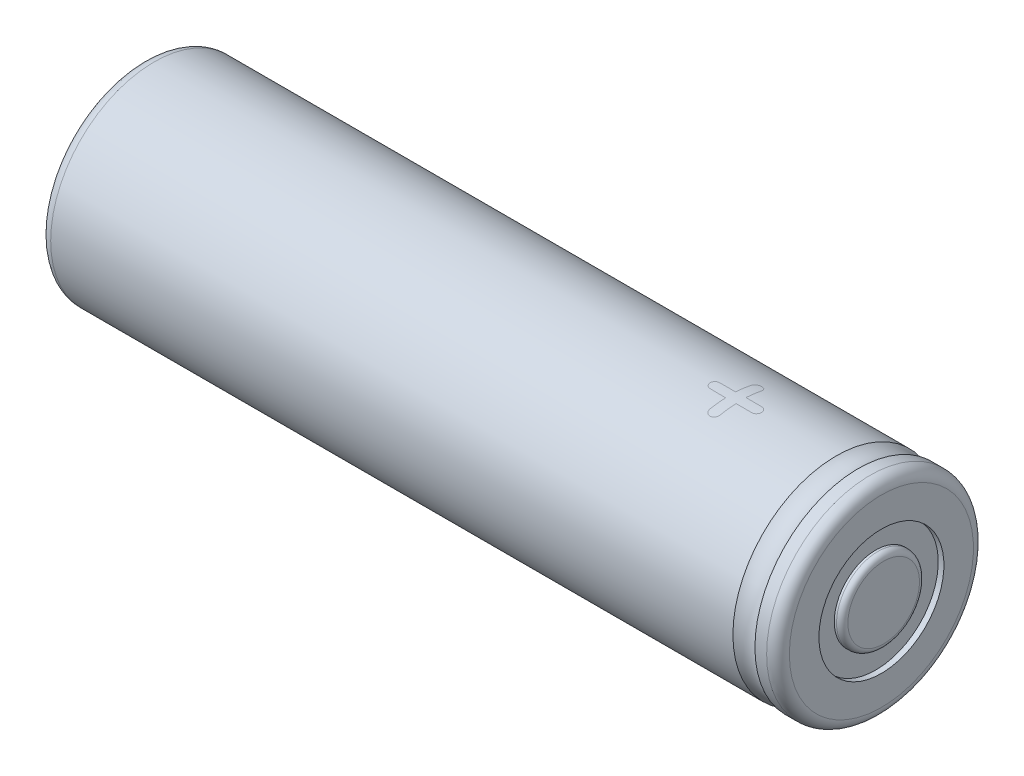
ISO-10303-21;
HEADER;
FILE_DESCRIPTION(('STEP AP214'),'2;1');
FILE_NAME('part.step','',(''),(''),'','','');
FILE_SCHEMA(('AUTOMOTIVE_DESIGN { 1 0 10303 214 1 1 1 1 }'));
ENDSEC;
DATA;
#1=APPLICATION_CONTEXT('core data for automotive mechanical design processes');
#2=APPLICATION_PROTOCOL_DEFINITION('international standard','automotive_design',2000,#1);
#3=PRODUCT_CONTEXT('',#1,'mechanical');
#4=PRODUCT('Part','Part','',(#3));
#5=PRODUCT_RELATED_PRODUCT_CATEGORY('part','',(#4));
#6=PRODUCT_DEFINITION_FORMATION('','',#4);
#7=PRODUCT_DEFINITION_CONTEXT('part definition',#1,'design');
#8=PRODUCT_DEFINITION('design','',#6,#7);
#9=PRODUCT_DEFINITION_SHAPE('','',#8);
#10=(LENGTH_UNIT() NAMED_UNIT(*) SI_UNIT(.MILLI.,.METRE.));
#11=(NAMED_UNIT(*) PLANE_ANGLE_UNIT() SI_UNIT($,.RADIAN.));
#12=(NAMED_UNIT(*) SI_UNIT($,.STERADIAN.) SOLID_ANGLE_UNIT());
#13=UNCERTAINTY_MEASURE_WITH_UNIT(LENGTH_MEASURE(1.E-05),#10,'distance_accuracy_value','');
#14=(GEOMETRIC_REPRESENTATION_CONTEXT(3) GLOBAL_UNCERTAINTY_ASSIGNED_CONTEXT((#13)) GLOBAL_UNIT_ASSIGNED_CONTEXT((#10,
#11,#12)) REPRESENTATION_CONTEXT('',''));
#15=CARTESIAN_POINT('',(0.,0.,0.));
#16=DIRECTION('',(0.,0.,1.));
#17=DIRECTION('',(1.,0.,0.));
#18=AXIS2_PLACEMENT_3D('',#15,#16,#17);
#19=CARTESIAN_POINT('',(0.,0.,0.));
#20=DIRECTION('',(-1.,0.,0.));
#21=DIRECTION('',(0.,0.,1.));
#22=AXIS2_PLACEMENT_3D('',#19,#20,#21);
#23=CYLINDRICAL_SURFACE('',#22,9.1);
#24=CARTESIAN_POINT('',(20.7315370676417,0.,0.));
#25=DIRECTION('',(-0.999897763752425,0.,-0.0142990224456045));
#26=DIRECTION('',(-0.0142990224456045,0.,0.999897763752425));
#27=AXIS2_PLACEMENT_3D('',#24,#25,#26);
#28=ELLIPSE('',#27,9.10093044497814,9.1);
#29=CARTESIAN_POINT('',(20.7058379382622,8.92079031075673,1.7970810308689));
#30=VERTEX_POINT('',#29);
#31=CARTESIAN_POINT('',(20.7251845941311,9.08915144775344,0.444213867187498));
#32=VERTEX_POINT('',#31);
#33=EDGE_CURVE('E11',#30,#32,#28,.T.);
#34=ORIENTED_EDGE('',*,*,#33,.F.);
#35=CARTESIAN_POINT('',(21.1609756097561,8.81651990302727,2.25365853658536));
#36=CARTESIAN_POINT('',(21.1446995451716,8.81685151612312,2.25235846850489));
#37=CARTESIAN_POINT('',(21.1283583713035,8.81719215066898,2.251026880612));
#38=CARTESIAN_POINT('',(21.0957821846135,8.81811883926329,2.24739576488378));
#39=CARTESIAN_POINT('',(21.0795473115098,8.81870516830138,2.24509515246822));
#40=CARTESIAN_POINT('',(21.0475636228122,8.82034546956267,2.23864130508761));
#41=CARTESIAN_POINT('',(21.0318123073446,8.82139633140025,2.23450039130884));
#42=CARTESIAN_POINT('',(21.0008548679472,8.82388493990462,2.22465298757242));
#43=CARTESIAN_POINT('',(20.9856486711145,8.82532263461691,2.21894670785296));
#44=CARTESIAN_POINT('',(20.9591426737148,8.82820371514138,2.20745244571866));
#45=CARTESIAN_POINT('',(20.9477113167555,8.82957814604123,2.20195097842354));
#46=CARTESIAN_POINT('',(20.9254439389612,8.83256818849453,2.18992639432641));
#47=CARTESIAN_POINT('',(20.9146071047449,8.83418345869364,2.18340472288083));
#48=CARTESIAN_POINT('',(20.8937046546578,8.837662372614,2.16928007092448));
#49=CARTESIAN_POINT('',(20.8836391954548,8.8395260665812,2.16167687164401));
#50=CARTESIAN_POINT('',(20.864206446094,8.84343088286279,2.1456463718753));
#51=CARTESIAN_POINT('',(20.8548404899988,8.84547232889591,2.13721756416442));
#52=CARTESIAN_POINT('',(20.8367248255444,8.84964971775683,2.11985370021394));
#53=CARTESIAN_POINT('',(20.8279718238473,8.85178503585409,2.11092190451267));
#54=CARTESIAN_POINT('',(20.8111335134032,8.8561596435771,2.0924928061347));
#55=CARTESIAN_POINT('',(20.8030471327971,8.85839875687958,2.08299645527056));
#56=CARTESIAN_POINT('',(20.7878221710654,8.86300814885538,2.06329553656829));
#57=CARTESIAN_POINT('',(20.7806833404411,8.86537839276697,2.05309115624282));
#58=CARTESIAN_POINT('',(20.7675047435772,8.8702337178362,2.03201142036657));
#59=CARTESIAN_POINT('',(20.7614660460014,8.87271890774513,2.02113542599691));
#60=CARTESIAN_POINT('',(20.75029515672,8.87775298127195,1.99890782250134));
#61=CARTESIAN_POINT('',(20.7451658011318,8.8803020368133,1.98755485737685));
#62=CARTESIAN_POINT('',(20.7356805911642,8.88542272935575,1.96453617556889));
#63=CARTESIAN_POINT('',(20.7313247040413,8.88799436539609,1.95287047214878));
#64=CARTESIAN_POINT('',(20.7235839331376,8.89316411178299,1.92919124924403));
#65=CARTESIAN_POINT('',(20.7202008704774,8.89576226247465,1.91717712318487));
#66=CARTESIAN_POINT('',(20.7160636710626,8.89966429141235,1.89895079776269));
#67=CARTESIAN_POINT('',(20.7148410627941,8.90096537814311,1.89284302496092));
#68=CARTESIAN_POINT('',(20.7127199303954,8.90356620960291,1.88057120369177));
#69=CARTESIAN_POINT('',(20.7118214178225,8.90486595428245,1.87440715322557));
#70=CARTESIAN_POINT('',(20.7103082804406,8.90740139314237,1.86232029453367));
#71=CARTESIAN_POINT('',(20.7096828800221,8.90863738330404,1.85639884074796));
#72=CARTESIAN_POINT('',(20.7086042738874,8.91110094102991,1.84453699391151));
#73=CARTESIAN_POINT('',(20.7081511221844,8.91232850583382,1.83859659550805));
#74=CARTESIAN_POINT('',(20.7073600161197,8.91476885636516,1.82672735185679));
#75=CARTESIAN_POINT('',(20.7070216639164,8.91598167879284,1.82079853899698));
#76=CARTESIAN_POINT('',(20.7064015870404,8.91839510410594,1.80894040004355));
#77=CARTESIAN_POINT('',(20.7061198166485,8.91959571610676,1.80301107826868));
#78=CARTESIAN_POINT('',(20.7058379382622,8.92079031075673,1.7970810308689));
#79=B_SPLINE_CURVE_WITH_KNOTS('',3,(#35,#36,#37,#38,#39,#40,#41,#42,#43,#44,#45,#46,#47,#48,#49,
#50,#51,#52,#53,#54,#55,#56,#57,#58,#59,#60,#61,#62,#63,#64,#65,#66,#67,#68,#69,#70,#71,#72,#73,
#74,#75,#76,#77,#78),.UNSPECIFIED.,.F.,.F.,(4,2,2,2,2,2,2,2,2,2,2,2,2,2,2,2,2,2,2,2,2,4),(0.,
0.0491110553033549,0.0982772248103529,0.14711906306833,0.195954344778998,0.234190793124285,
0.272373553221783,0.310564047878256,0.348825610371183,0.386862676823928,0.424837339584071,
0.462801983340951,0.500803311383232,0.538921151679484,0.577037377933016,0.615224499779135,
0.63430664353342,0.653389467685543,0.671630403991138,0.689877055512403,0.708059810857064,
0.726227814564888),.UNSPECIFIED.);
#80=CARTESIAN_POINT('',(21.1609756097561,8.81651990302727,2.25365853658536));
#81=VERTEX_POINT('',#80);
#82=EDGE_CURVE('E59',#81,#30,#79,.T.);
#83=ORIENTED_EDGE('',*,*,#82,.F.);
#84=CARTESIAN_POINT('',(21.6146341463415,8.92057072275262,1.79817073170732));
#85=CARTESIAN_POINT('',(21.6141890630882,8.9189034028006,1.8064422936715));
#86=CARTESIAN_POINT('',(21.6137434614697,8.91722406305708,1.81471382793186));
#87=CARTESIAN_POINT('',(21.6126996098218,8.9138406714741,1.8312607239287));
#88=CARTESIAN_POINT('',(21.6121010268624,8.91213657348113,1.83953605421109));
#89=CARTESIAN_POINT('',(21.6106020240845,8.90871443333463,1.85603824397045));
#90=CARTESIAN_POINT('',(21.6097023290141,8.9069964342372,1.86426517202132));
#91=CARTESIAN_POINT('',(21.6074360100389,8.90355205742919,1.88064636579637));
#92=CARTESIAN_POINT('',(21.6060698430847,8.90182568954196,1.88880069464702));
#93=CARTESIAN_POINT('',(21.6011396658987,8.89666802142218,1.91299997825978));
#94=CARTESIAN_POINT('',(21.5967378421304,8.89323770352368,1.92887976237281));
#95=CARTESIAN_POINT('',(21.5888930911582,8.88812205313262,1.95226802326923));
#96=CARTESIAN_POINT('',(21.5860691519793,8.88642081922854,1.95999661002743));
#97=CARTESIAN_POINT('',(21.5800676922365,8.88302683177248,1.97532169712688));
#98=CARTESIAN_POINT('',(21.5768900514765,8.88133408130885,1.98291815154621));
#99=CARTESIAN_POINT('',(21.5683069029977,8.87702917139047,2.0021229683645));
#100=CARTESIAN_POINT('',(21.5626429993904,8.87442761562191,2.01362050077341));
#101=CARTESIAN_POINT('',(21.55023963247,8.86931162616813,2.03603599358726));
#102=CARTESIAN_POINT('',(21.5435011875713,8.86679711270644,2.04695448985503));
#103=CARTESIAN_POINT('',(21.5215449829467,8.85945961637271,2.07856924077725));
#104=CARTESIAN_POINT('',(21.5045937816796,8.85484671884553,2.09810684447824));
#105=CARTESIAN_POINT('',(21.4774937895854,8.8482510183197,2.12568590813252));
#106=CARTESIAN_POINT('',(21.4681811609008,8.84610630785324,2.13459138207739));
#107=CARTESIAN_POINT('',(21.4488852504345,8.84196795437397,2.15166909688632));
#108=CARTESIAN_POINT('',(21.4389034275195,8.8399740016917,2.15984284750482));
#109=CARTESIAN_POINT('',(21.418136534536,8.83622744400929,2.1751199492411));
#110=CARTESIAN_POINT('',(21.4073531603897,8.83447435060533,2.18222546931332));
#111=CARTESIAN_POINT('',(21.3850755602787,8.83122997200061,2.19531845250554));
#112=CARTESIAN_POINT('',(21.3735803101218,8.82973907644543,2.20130425246427));
#113=CARTESIAN_POINT('',(21.3507690088202,8.8270602583822,2.21202072785641));
#114=CARTESIAN_POINT('',(21.3394778670917,8.82586018331072,2.21680232382134));
#115=CARTESIAN_POINT('',(21.3165768814203,8.82365644792709,2.22555771154996));
#116=CARTESIAN_POINT('',(21.3049672902893,8.82265263667228,2.22953212419441));
#117=CARTESIAN_POINT('',(21.2814057723453,8.82087752519799,2.23654483744762));
#118=CARTESIAN_POINT('',(21.2694529086563,8.82010694413478,2.239580243288));
#119=CARTESIAN_POINT('',(21.2453066726835,8.81884829707004,2.24453148578082));
#120=CARTESIAN_POINT('',(21.2331133006427,8.81836023078314,2.24644732356417));
#121=CARTESIAN_POINT('',(21.2109046856477,8.8176422429251,2.24926362121947));
#122=CARTESIAN_POINT('',(21.2009038180664,8.81738126828142,2.25028635791437));
#123=CARTESIAN_POINT('',(21.1809256097143,8.81692068497629,2.25209019494509));
#124=CARTESIAN_POINT('',(21.1709483815915,8.81672079174223,2.25287241593119));
#125=CARTESIAN_POINT('',(21.1609756097561,8.81651990302727,2.25365853658536));
#126=B_SPLINE_CURVE_WITH_KNOTS('',3,(#84,#85,#86,#87,#88,#89,#90,#91,#92,#93,#94,#95,#96,#97,
#98,#99,#100,#101,#102,#103,#104,#105,#106,#107,#108,#109,#110,#111,#112,#113,#114,#115,#116,
#117,#118,#119,#120,#121,#122,#123,#124,#125),.UNSPECIFIED.,.F.,.F.,(4,2,2,2,2,2,2,2,2,2,2,2,2,
2,2,2,2,2,2,2,4),(0.,0.0253529277257796,0.0507615074154624,0.0761093657052647,0.101432464415169,
0.151778818140593,0.176981550558468,0.202192873760443,0.241382442727475,0.280535087500243,
0.358898457304724,0.398083485479292,0.437185704771054,0.476207425631231,0.515286654481036,
0.55221680554551,0.589118441657753,0.626132729765143,0.663146980482989,0.693313418812502,
0.723337092913159),.UNSPECIFIED.);
#127=CARTESIAN_POINT('',(21.6146341463415,8.92057072275262,1.79817073170732));
#128=VERTEX_POINT('',#127);
#129=EDGE_CURVE('E188',#128,#81,#126,.T.);
#130=ORIENTED_EDGE('',*,*,#129,.F.);
#131=CARTESIAN_POINT('',(21.6242145852634,0.,0.));
#132=DIRECTION('',(0.999985807146421,0.,0.00532780496272372));
#133=DIRECTION('',(-0.00532780496272372,0.,0.999985807146421));
#134=AXIS2_PLACEMENT_3D('',#131,#132,#133);
#135=ELLIPSE('',#134,9.10012915680068,9.1);
#136=CARTESIAN_POINT('',(21.6219512195122,9.09007876043638,0.4248154058689));
#137=VERTEX_POINT('',#136);
#138=EDGE_CURVE('E196',#137,#128,#135,.T.);
#139=ORIENTED_EDGE('',*,*,#138,.F.);
#140=DIRECTION('',(-1.,0.,0.));
#141=VECTOR('',#140,1.);
#142=CARTESIAN_POINT('',(0.,9.09007876043638,0.4248154058689));
#143=LINE('',#142,#141);
#144=CARTESIAN_POINT('',(22.9748701886433,9.09007876043638,0.4248154058689));
#145=VERTEX_POINT('',#144);
#146=EDGE_CURVE('E463',#145,#137,#143,.T.);
#147=ORIENTED_EDGE('',*,*,#146,.F.);
#148=CARTESIAN_POINT('',(23.4292682926829,9.09999540353938,-0.00914634146341638));
#149=CARTESIAN_POINT('',(23.4281208493471,9.10001118956765,0.00578389545966615));
#150=CARTESIAN_POINT('',(23.4269951304369,9.09998876246969,0.020775448518548));
#151=CARTESIAN_POINT('',(23.4238937268498,9.09987117729846,0.0506261737238683));
#152=CARTESIAN_POINT('',(23.4219200158797,9.09977618771785,0.0654855719892408));
#153=CARTESIAN_POINT('',(23.4162293556709,9.0995170836883,0.0949027810557783));
#154=CARTESIAN_POINT('',(23.4125106721232,9.09935290048515,0.109460276734754));
#155=CARTESIAN_POINT('',(23.4036427257961,9.09896288286951,0.138133445325911));
#156=CARTESIAN_POINT('',(23.3984914443277,9.09873696146892,0.152248463277068));
#157=CARTESIAN_POINT('',(23.3881434578997,9.09827444683621,0.177572934796028));
#158=CARTESIAN_POINT('',(23.3831175893705,9.098046888879,0.188852879291572));
#159=CARTESIAN_POINT('',(23.3721490726587,9.09756155434225,0.210938795317966));
#160=CARTESIAN_POINT('',(23.3662085800642,9.09730384914822,0.221745806474074));
#161=CARTESIAN_POINT('',(23.3531510201058,9.09677105954883,0.24262281452744));
#162=CARTESIAN_POINT('',(23.3460345590837,9.09649598414467,0.252693187402863));
#163=CARTESIAN_POINT('',(23.3307913954609,9.0959374976923,0.2720581937067));
#164=CARTESIAN_POINT('',(23.32266249938,9.0956540695978,0.281351067250115));
#165=CARTESIAN_POINT('',(23.3058337253621,9.0950810051936,0.299301534798952));
#166=CARTESIAN_POINT('',(23.2971370126706,9.09479140850018,0.307962161512337));
#167=CARTESIAN_POINT('',(23.2792657822408,9.09420693475886,0.324761530563112));
#168=CARTESIAN_POINT('',(23.2700917609811,9.09391206339902,0.332900796282754));
#169=CARTESIAN_POINT('',(23.2510108589374,9.09333402778027,0.348333098158552));
#170=CARTESIAN_POINT('',(23.2411027729633,9.09305088401934,0.355624689827659));
#171=CARTESIAN_POINT('',(23.2204683831979,9.09252084498018,0.368930958894549));
#172=CARTESIAN_POINT('',(23.2097425975252,9.09227392703359,0.374946435883762));
#173=CARTESIAN_POINT('',(23.1883377058832,9.09182879071959,0.385585248533543));
#174=CARTESIAN_POINT('',(23.1776858140358,9.09162869404729,0.390265163093818));
#175=CARTESIAN_POINT('',(23.156089014944,9.09125178281849,0.39894809241368));
#176=CARTESIAN_POINT('',(23.1451435737797,9.0910750147144,0.402949761004605));
#177=CARTESIAN_POINT('',(23.1230032205378,9.09074905623666,0.410237457766873));
#178=CARTESIAN_POINT('',(23.1118081183881,9.09059988773829,0.4135229186408));
#179=CARTESIAN_POINT('',(23.0891689065356,9.09034929986164,0.418995332189791));
#180=CARTESIAN_POINT('',(23.0777256671608,9.09024773524609,0.421185627548758));
#181=CARTESIAN_POINT('',(23.0510765968299,9.09008774644941,0.424629136688561));
#182=CARTESIAN_POINT('',(23.0358120045286,9.09005270774622,0.425375926326103));
#183=CARTESIAN_POINT('',(23.0052844051174,9.09003816577219,0.425679795523179));
#184=CARTESIAN_POINT('',(22.9900214512383,9.09005855599968,0.425239156633376));
#185=CARTESIAN_POINT('',(22.9748701886433,9.09007876043638,0.4248154058689));
#186=B_SPLINE_CURVE_WITH_KNOTS('',3,(#148,#149,#150,#151,#152,#153,#154,#155,#156,#157,#158,
#159,#160,#161,#162,#163,#164,#165,#166,#167,#168,#169,#170,#171,#172,#173,#174,#175,#176,#177,
#178,#179,#180,#181,#182,#183,#184,#185),.UNSPECIFIED.,.F.,.F.,(4,2,2,2,2,2,2,2,2,2,2,2,2,2,2,2,
2,2,4),(0.,0.0450273109756248,0.0899503835635508,0.134918199574334,0.179949704105758,
0.216976682470676,0.253917694912855,0.290839719267321,0.327843175463298,0.364655550166914,
0.401430371086206,0.438266967352991,0.475080413821632,0.509957684044154,0.544903387292589,
0.579876670736081,0.614742546343617,0.660499322225608,0.706168242773928),.UNSPECIFIED.);
#187=CARTESIAN_POINT('',(23.4292682926829,9.09999540353938,-0.00914634146341638));
#188=VERTEX_POINT('',#187);
#189=EDGE_CURVE('E180',#188,#145,#186,.T.);
#190=ORIENTED_EDGE('',*,*,#189,.F.);
#191=CARTESIAN_POINT('',(22.9737804878049,9.08813045186157,-0.464634146341465));
#192=CARTESIAN_POINT('',(22.982244753439,9.08815370048562,-0.464178924296654));
#193=CARTESIAN_POINT('',(22.9907116413474,9.08817701165985,-0.463722727406795));
#194=CARTESIAN_POINT('',(23.0076562172441,9.088231900067,-0.462646031817967));
#195=CARTESIAN_POINT('',(23.0161338772456,9.0882634983448,-0.462025114769526));
#196=CARTESIAN_POINT('',(23.0330428154186,9.08834297562677,-0.460459080436611));
#197=CARTESIAN_POINT('',(23.0414741551406,9.08839081761746,-0.45951470016424));
#198=CARTESIAN_POINT('',(23.0582563577063,9.08851161543601,-0.457119328497514));
#199=CARTESIAN_POINT('',(23.0666073053503,9.08858454090363,-0.455668949517724));
#200=CARTESIAN_POINT('',(23.0913374469466,9.08884463360491,-0.450460939474377));
#201=CARTESIAN_POINT('',(23.1075385924805,9.08907363207815,-0.445836789886009));
#202=CARTESIAN_POINT('',(23.1313829731244,9.08947092829883,-0.437636543986923));
#203=CARTESIAN_POINT('',(23.1392600501238,9.08961244075608,-0.434690036718647));
#204=CARTESIAN_POINT('',(23.1548690056065,9.08990931361867,-0.428437291030943));
#205=CARTESIAN_POINT('',(23.1626009230062,9.09006467024638,-0.425131150689581));
#206=CARTESIAN_POINT('',(23.181761484244,9.09047164067522,-0.41635721738095));
#207=CARTESIAN_POINT('',(23.1930793172072,9.09073215852568,-0.410642608491133));
#208=CARTESIAN_POINT('',(23.2150928343565,9.0912877162593,-0.398154814019927));
#209=CARTESIAN_POINT('',(23.2257897050198,9.09158268682952,-0.391383744938246));
#210=CARTESIAN_POINT('',(23.2567615751343,9.09250949261085,-0.369430651273671));
#211=CARTESIAN_POINT('',(23.2758794303217,9.09318239866712,-0.352625439654171));
#212=CARTESIAN_POINT('',(23.3028543987072,9.09416800276973,-0.325870895225242));
#213=CARTESIAN_POINT('',(23.3115577357682,9.09449239195037,-0.316700853722561));
#214=CARTESIAN_POINT('',(23.328229741459,9.09513330118516,-0.29772338712927));
#215=CARTESIAN_POINT('',(23.3361997898363,9.09544983516419,-0.287917220836018));
#216=CARTESIAN_POINT('',(23.3510993632564,9.09607093303421,-0.267575481125202));
#217=CARTESIAN_POINT('',(23.3580313083104,9.09637552350319,-0.257041690506255));
#218=CARTESIAN_POINT('',(23.3708184946283,9.09696318969828,-0.235326531702933));
#219=CARTESIAN_POINT('',(23.3766723896489,9.09724623826816,-0.224144376450886));
#220=CARTESIAN_POINT('',(23.387248136189,9.09777056923913,-0.201723565761601));
#221=CARTESIAN_POINT('',(23.3920016053193,9.09801294126943,-0.190499641662083));
#222=CARTESIAN_POINT('',(23.4006653827326,9.0984610623369,-0.167737481001098));
#223=CARTESIAN_POINT('',(23.40457616114,9.09866683178284,-0.156199423757882));
#224=CARTESIAN_POINT('',(23.4114934638919,9.0990383854385,-0.132807200124373));
#225=CARTESIAN_POINT('',(23.4144968026332,9.09920402838837,-0.120952075573328));
#226=CARTESIAN_POINT('',(23.4194633987658,9.09949055075732,-0.097028691916884));
#227=CARTESIAN_POINT('',(23.4214267023467,9.09961143216427,-0.0849604423012982));
#228=CARTESIAN_POINT('',(23.424435172751,9.09979331962335,-0.0622431482214596));
#229=CARTESIAN_POINT('',(23.4255640984291,9.09985989831781,-0.0516040410779573));
#230=CARTESIAN_POINT('',(23.4275483049387,9.0999555527544,-0.0303565998557121));
#231=CARTESIAN_POINT('',(23.4284050222077,9.09998482789986,-0.0197484071710816));
#232=CARTESIAN_POINT('',(23.4292682926829,9.09999540353938,-0.00914634146341638));
#233=B_SPLINE_CURVE_WITH_KNOTS('',3,(#191,#192,#193,#194,#195,#196,#197,#198,#199,#200,#201,
#202,#203,#204,#205,#206,#207,#208,#209,#210,#211,#212,#213,#214,#215,#216,#217,#218,#219,#220,
#221,#222,#223,#224,#225,#226,#227,#228,#229,#230,#231,#232),.UNSPECIFIED.,.F.,.F.,(4,2,2,2,2,2,
2,2,2,2,2,2,2,2,2,2,2,2,2,2,4),(0.,0.0254340130217014,0.05093325121388,0.0763747715963511,
0.101785606105062,0.152176459067852,0.177406039934964,0.202628757434615,0.240624581342772,
0.278545239787364,0.354509443579337,0.392446331500804,0.430310311988243,0.468084602497733,
0.50590574943264,0.542446369709141,0.578966551445999,0.61561348770599,0.652258796282871,
0.684351779784454,0.716272482943191),.UNSPECIFIED.);
#234=CARTESIAN_POINT('',(22.9737804878049,9.08813045186157,-0.464634146341465));
#235=VERTEX_POINT('',#234);
#236=EDGE_CURVE('E172',#235,#188,#233,.T.);
#237=ORIENTED_EDGE('',*,*,#236,.F.);
#238=CARTESIAN_POINT('',(110.407694895674,0.,0.));
#239=DIRECTION('',(0.00531404305786231,0.,-0.999985880373508));
#240=DIRECTION('',(-0.999985880373508,0.,-0.00531404305786231));
#241=AXIS2_PLACEMENT_3D('',#238,#239,#240);
#242=ELLIPSE('',#241,1712.44378355878,9.1);
#243=CARTESIAN_POINT('',(21.5968684498857,9.08775341029899,-0.471951219512197));
#244=VERTEX_POINT('',#243);
#245=EDGE_CURVE('E474',#244,#235,#242,.T.);
#246=ORIENTED_EDGE('',*,*,#245,.F.);
#247=CARTESIAN_POINT('',(21.5968684498857,0.,0.));
#248=DIRECTION('',(1.,0.,0.));
#249=DIRECTION('',(0.,0.,-1.));
#250=AXIS2_PLACEMENT_3D('',#247,#248,#249);
#251=CIRCLE('',#250,9.1);
#252=CARTESIAN_POINT('',(21.5968684498857,8.91514715496054,-1.82487018864329));
#253=VERTEX_POINT('',#252);
#254=EDGE_CURVE('E479',#253,#244,#251,.T.);
#255=ORIENTED_EDGE('',*,*,#254,.F.);
#256=CARTESIAN_POINT('',(21.1719512195122,8.80993394129436,-2.27926829268293));
#257=CARTESIAN_POINT('',(21.1865316014072,8.81022651354335,-2.27813548432237));
#258=CARTESIAN_POINT('',(21.2011675517398,8.81051369556689,-2.27702612411326));
#259=CARTESIAN_POINT('',(21.2303370769914,8.81128809259746,-2.27402888930656));
#260=CARTESIAN_POINT('',(21.2448707089271,8.81177518544483,-2.27214149014272));
#261=CARTESIAN_POINT('',(21.2736156562705,8.81315886982819,-2.26676802110397));
#262=CARTESIAN_POINT('',(21.2878274826658,8.81405475618989,-2.26328470416661));
#263=CARTESIAN_POINT('',(21.3157892905751,8.81620440399447,-2.25489656096359));
#264=CARTESIAN_POINT('',(21.3295390291629,8.81745835048416,-2.24999099965659));
#265=CARTESIAN_POINT('',(21.3538228852717,8.81995574819648,-2.2401788215477));
#266=CARTESIAN_POINT('',(21.3644444023008,8.82114991805928,-2.23547352523137));
#267=CARTESIAN_POINT('',(21.3852523539525,8.82373608826004,-2.2252436619206));
#268=CARTESIAN_POINT('',(21.3954393364801,8.82512782927776,-2.21972016843679));
#269=CARTESIAN_POINT('',(21.4151773869095,8.82815003711759,-2.20766964629837));
#270=CARTESIAN_POINT('',(21.4247281788761,8.82978060655857,-2.20114218620258));
#271=CARTESIAN_POINT('',(21.4430700505761,8.83325959441451,-2.18713889617956));
#272=CARTESIAN_POINT('',(21.4518604460704,8.83510820557021,-2.17966222673415));
#273=CARTESIAN_POINT('',(21.4687315154896,8.83892759674932,-2.16412166067135));
#274=CARTESIAN_POINT('',(21.4768172711136,8.84089729002601,-2.15606289884562));
#275=CARTESIAN_POINT('',(21.4924964973481,8.84492062197044,-2.13949815692725));
#276=CARTESIAN_POINT('',(21.5000898891198,8.8469742739965,-2.13099210560613));
#277=CARTESIAN_POINT('',(21.514652229518,8.85117367069491,-2.11348186979702));
#278=CARTESIAN_POINT('',(21.5216213979955,8.85331938254692,-2.10447786251026));
#279=CARTESIAN_POINT('',(21.5347391770737,8.85771016202638,-2.08591978826195));
#280=CARTESIAN_POINT('',(21.5408884748464,8.85995514432184,-2.07636619167509));
#281=CARTESIAN_POINT('',(21.5519669228379,8.8644199001468,-2.05721936372698));
#282=CARTESIAN_POINT('',(21.5569412597486,8.86663546669543,-2.04765127307922));
#283=CARTESIAN_POINT('',(21.5660346761764,8.87112303656488,-2.02812144877161));
#284=CARTESIAN_POINT('',(21.5701531435323,8.87339507898852,-2.01815943938167));
#285=CARTESIAN_POINT('',(21.5774974979848,8.87797809275308,-1.99790212857174));
#286=CARTESIAN_POINT('',(21.5807219886468,8.8802891190823,-1.98760633346736));
#287=CARTESIAN_POINT('',(21.5862748391796,8.88492292534587,-1.9667888183272));
#288=CARTESIAN_POINT('',(21.5886039092308,8.88724569447904,-1.95626728435303));
#289=CARTESIAN_POINT('',(21.5922666776134,8.89174340932145,-1.93571767035525));
#290=CARTESIAN_POINT('',(21.593652710964,8.89391867470098,-1.92569895767968));
#291=CARTESIAN_POINT('',(21.5956636755487,8.89825242476646,-1.90557335936342));
#292=CARTESIAN_POINT('',(21.5962877785428,8.90041088866174,-1.89546638977874));
#293=CARTESIAN_POINT('',(21.5970283076082,8.90468840463755,-1.87526817476465));
#294=CARTESIAN_POINT('',(21.5971464866072,8.90680756742915,-1.86517699634014));
#295=CARTESIAN_POINT('',(21.5971320529872,8.91100619648758,-1.84501338621515));
#296=CARTESIAN_POINT('',(21.5970001031093,8.91308575295151,-1.83494097555874));
#297=CARTESIAN_POINT('',(21.5968684498857,8.91514715496054,-1.82487018864329));
#298=B_SPLINE_CURVE_WITH_KNOTS('',3,(#256,#257,#258,#259,#260,#261,#262,#263,#264,#265,#266,
#267,#268,#269,#270,#271,#272,#273,#274,#275,#276,#277,#278,#279,#280,#281,#282,#283,#284,#285,
#286,#287,#288,#289,#290,#291,#292,#293,#294,#295,#296,#297),.UNSPECIFIED.,.F.,.F.,(4,2,2,2,2,2,
2,2,2,2,2,2,2,2,2,2,2,2,2,2,4),(0.,0.0439756519734563,0.0879244716271192,0.131797763920123,
0.175693771258747,0.21070198383622,0.245664664400734,0.280642411905861,0.315651313482311,
0.350382202141459,0.385118638358276,0.419842791922466,0.454537656088675,0.487523237341808,
0.520532330956155,0.553592699521735,0.586626792722073,0.617632606731382,0.648672095012396,
0.679603950042862,0.710453962613161),.UNSPECIFIED.);
#299=CARTESIAN_POINT('',(21.1719512195122,8.80993394129436,-2.27926829268293));
#300=VERTEX_POINT('',#299);
#301=EDGE_CURVE('E163',#300,#253,#298,.T.);
#302=ORIENTED_EDGE('',*,*,#301,.F.);
#303=CARTESIAN_POINT('',(20.7237804878049,8.91537013994945,-1.82378048780488));
#304=CARTESIAN_POINT('',(20.7244406037768,8.91357199745777,-1.83257067810455));
#305=CARTESIAN_POINT('',(20.7251015314456,8.9117604110163,-1.84136007587941));
#306=CARTESIAN_POINT('',(20.7265693337254,8.90811071460535,-1.85893627253013));
#307=CARTESIAN_POINT('',(20.7273764516993,8.90627256518404,-1.86772304222425));
#308=CARTESIAN_POINT('',(20.7292822055083,8.90257131293706,-1.88528638471382));
#309=CARTESIAN_POINT('',(20.7303816023271,8.90070815720491,-1.89406286993886));
#310=CARTESIAN_POINT('',(20.7330288045744,8.89697102945045,-1.91154031075334));
#311=CARTESIAN_POINT('',(20.7345762845167,8.89509706624363,-1.9202413164624));
#312=CARTESIAN_POINT('',(20.7400253740028,8.88947149423401,-1.94617806617928));
#313=CARTESIAN_POINT('',(20.74473382819,8.88571571064869,-1.96324987729814));
#314=CARTESIAN_POINT('',(20.756057108345,8.87825481622357,-1.99671869925177));
#315=CARTESIAN_POINT('',(20.76266921538,8.87454964095183,-2.01311663465926));
#316=CARTESIAN_POINT('',(20.7805731116973,8.8658670256783,-2.05107497767429));
#317=CARTESIAN_POINT('',(20.7926898957299,8.86093384095769,-2.072263864165));
#318=CARTESIAN_POINT('',(20.8203322126274,8.85145312428598,-2.11239239353716));
#319=CARTESIAN_POINT('',(20.8358541362168,8.84690519101014,-2.13133438550384));
#320=CARTESIAN_POINT('',(20.8616011353959,8.84056213047152,-2.1574389727912));
#321=CARTESIAN_POINT('',(20.8706079124408,8.83852517140118,-2.16576539140597));
#322=CARTESIAN_POINT('',(20.8893291980323,8.83462114453049,-2.18163605047057));
#323=CARTESIAN_POINT('',(20.8990441530786,8.83275418561128,-2.18917979005791));
#324=CARTESIAN_POINT('',(20.9190216571532,8.82919124636357,-2.20350544318902));
#325=CARTESIAN_POINT('',(20.9292832508112,8.8274949817924,-2.21028862545036));
#326=CARTESIAN_POINT('',(20.9503227746716,8.82428978985768,-2.22305033980624));
#327=CARTESIAN_POINT('',(20.961100566093,8.82278081252902,-2.22902908654669));
#328=CARTESIAN_POINT('',(20.9833933636591,8.8199722835059,-2.24011660465757));
#329=CARTESIAN_POINT('',(20.9949186549095,8.81867739590296,-2.24520611134958));
#330=CARTESIAN_POINT('',(21.0184381981612,8.81637359392435,-2.25423569746744));
#331=CARTESIAN_POINT('',(21.0304324569702,8.81536468370186,-2.25817576020021));
#332=CARTESIAN_POINT('',(21.0547759866323,8.81363270864862,-2.26492615552751));
#333=CARTESIAN_POINT('',(21.0671257921744,8.81291010135771,-2.26773467993399));
#334=CARTESIAN_POINT('',(21.0920450159465,8.81176288163467,-2.27218847799736));
#335=CARTESIAN_POINT('',(21.1046145158231,8.8113383825126,-2.2738333093396));
#336=CARTESIAN_POINT('',(21.1263381901833,8.81076272067806,-2.27606262020662));
#337=CARTESIAN_POINT('',(21.135477110013,8.8105684494472,-2.27681447701544));
#338=CARTESIAN_POINT('',(21.1537284742555,8.81022768601304,-2.27813267453928));
#339=CARTESIAN_POINT('',(21.1628408525054,8.81008098254098,-2.27869983561721));
#340=CARTESIAN_POINT('',(21.1719512195122,8.80993394129436,-2.27926829268293));
#341=B_SPLINE_CURVE_WITH_KNOTS('',3,(#303,#304,#305,#306,#307,#308,#309,#310,#311,#312,#313,
#314,#315,#316,#317,#318,#319,#320,#321,#322,#323,#324,#325,#326,#327,#328,#329,#330,#331,#332,
#333,#334,#335,#336,#337,#338,#339,#340),.UNSPECIFIED.,.F.,.F.,(4,2,2,2,2,2,2,2,2,2,2,2,2,2,2,2,
2,2,4),(0.,0.0269926686728523,0.054030692076475,0.0811398136681195,0.108229292465418,
0.16240111626455,0.216495948615596,0.290887621572727,0.365200820864892,0.40245761773296,
0.439738111295909,0.476955460207725,0.514162858711581,0.552096703274211,0.590031098712827,
0.628025874807441,0.66603508480279,0.693549544300659,0.720940070885291),.UNSPECIFIED.);
#342=CARTESIAN_POINT('',(20.7237804878049,8.91537013994945,-1.82378048780488));
#343=VERTEX_POINT('',#342);
#344=EDGE_CURVE('E154',#343,#300,#341,.T.);
#345=ORIENTED_EDGE('',*,*,#344,.F.);
#346=CARTESIAN_POINT('',(20.6999461740492,0.,0.));
#347=DIRECTION('',(-0.999914616382009,0.,-0.0130675148983647));
#348=DIRECTION('',(-0.0130675148983647,0.,0.999914616382009));
#349=AXIS2_PLACEMENT_3D('',#346,#347,#348);
#350=ELLIPSE('',#349,9.10077705727168,9.1);
#351=CARTESIAN_POINT('',(20.7057861328125,9.0890213218199,-0.446868449885673));
#352=VERTEX_POINT('',#351);
#353=EDGE_CURVE('E492',#352,#343,#350,.T.);
#354=ORIENTED_EDGE('',*,*,#353,.F.);
#355=DIRECTION('',(-1.,0.,0.));
#356=VECTOR('',#355,1.);
#357=CARTESIAN_POINT('',(0.,9.0890213218199,-0.446868449885673));
#358=LINE('',#357,#356);
#359=CARTESIAN_POINT('',(19.3528671636814,9.0890213218199,-0.446868449885673));
#360=VERTEX_POINT('',#359);
#361=EDGE_CURVE('E497',#360,#352,#358,.F.);
#362=ORIENTED_EDGE('',*,*,#361,.F.);
#363=CARTESIAN_POINT('',(18.8963414634146,9.099973524355,-0.0219512195121971));
#364=CARTESIAN_POINT('',(18.8975349072868,9.09993689243342,-0.0375259611356789));
#365=CARTESIAN_POINT('',(18.8987285103499,9.09985827442531,-0.0531696399060796));
#366=CARTESIAN_POINT('',(18.9020669624319,9.09962230776641,-0.0843315763062963));
#367=CARTESIAN_POINT('',(18.9042110323187,9.09946502358762,-0.0998499260854827));
#368=CARTESIAN_POINT('',(18.9103835270771,9.09907793390595,-0.130441659677079));
#369=CARTESIAN_POINT('',(18.9144017468056,9.09884852332474,-0.145516989002737));
#370=CARTESIAN_POINT('',(18.9239543675164,9.09832597507283,-0.175170225240194));
#371=CARTESIAN_POINT('',(18.9294898372999,9.0980327925092,-0.189747773327144));
#372=CARTESIAN_POINT('',(18.9403117670631,9.09747140096469,-0.214776716463538));
#373=CARTESIAN_POINT('',(18.9453161381691,9.09721519401944,-0.225350590926082));
#374=CARTESIAN_POINT('',(18.9562307137892,9.09668000975007,-0.246006300065252));
#375=CARTESIAN_POINT('',(18.9621391995941,9.09640107608988,-0.256089021452913));
#376=CARTESIAN_POINT('',(18.9750411885377,9.09583221343058,-0.275557422593053));
#377=CARTESIAN_POINT('',(18.9820361956156,9.09554226961821,-0.284942109103759));
#378=CARTESIAN_POINT('',(18.9969094127807,9.094958768982,-0.302996644718762));
#379=CARTESIAN_POINT('',(19.0047890871257,9.09466520690595,-0.311665266218186));
#380=CARTESIAN_POINT('',(19.0210715917737,9.09407786887373,-0.328354523065873));
#381=CARTESIAN_POINT('',(19.0294698169112,9.09378411278226,-0.336379721067111));
#382=CARTESIAN_POINT('',(19.0467338995774,9.09319661460334,-0.351902237062148));
#383=CARTESIAN_POINT('',(19.0555994726184,9.09290287261386,-0.359399869854899));
#384=CARTESIAN_POINT('',(19.0738834703092,9.0923280021264,-0.37366085898225));
#385=CARTESIAN_POINT('',(19.0833007823835,9.09204685013338,-0.380425619610654));
#386=CARTESIAN_POINT('',(19.1027326521137,9.09151051618334,-0.393035125475645));
#387=CARTESIAN_POINT('',(19.1127470696922,9.09125532817304,-0.39888008533017));
#388=CARTESIAN_POINT('',(19.1340580752605,9.0907610767367,-0.409995437489377));
#389=CARTESIAN_POINT('',(19.1453944757144,9.09052466282267,-0.415189733002503));
#390=CARTESIAN_POINT('',(19.168544266646,9.09009949242818,-0.424396669502729));
#391=CARTESIAN_POINT('',(19.1803578928314,9.08991075984037,-0.428408718244604));
#392=CARTESIAN_POINT('',(19.2043729129612,9.08958585635304,-0.435247916171234));
#393=CARTESIAN_POINT('',(19.2165756581161,9.0894498967241,-0.438070306487104));
#394=CARTESIAN_POINT('',(19.2411907340302,9.08923435730034,-0.44251971989554));
#395=CARTESIAN_POINT('',(19.2536029394568,9.08915474493441,-0.444147433581985));
#396=CARTESIAN_POINT('',(19.2805370559118,9.08904069339458,-0.446476345353063));
#397=CARTESIAN_POINT('',(19.295073317183,9.08901572355336,-0.446983461478308));
#398=CARTESIAN_POINT('',(19.3240423778417,9.08900135737741,-0.447273225236768));
#399=CARTESIAN_POINT('',(19.3384750696324,9.08901167670431,-0.447061663623643));
#400=CARTESIAN_POINT('',(19.3528671636814,9.0890213218199,-0.446868449885672));
#401=B_SPLINE_CURVE_WITH_KNOTS('',3,(#363,#364,#365,#366,#367,#368,#369,#370,#371,#372,#373,
#374,#375,#376,#377,#378,#379,#380,#381,#382,#383,#384,#385,#386,#387,#388,#389,#390,#391,#392,
#393,#394,#395,#396,#397,#398,#399,#400),.UNSPECIFIED.,.F.,.F.,(4,2,2,2,2,2,2,2,2,2,2,2,2,2,2,2,
2,2,4),(0.,0.0469818369599602,0.0939252322168754,0.140615942690019,0.187339628554808,
0.222412590416555,0.257419688888855,0.292475682482329,0.327590579101443,0.362429127695882,
0.39724670862345,0.431996347638431,0.466737866428255,0.504088022065062,0.541456856536825,
0.578973786808812,0.61646901295481,0.660071153335096,0.703322805077136),.UNSPECIFIED.);
#402=CARTESIAN_POINT('',(18.8963414634146,9.099973524355,-0.0219512195121971));
#403=VERTEX_POINT('',#402);
#404=EDGE_CURVE('E122',#403,#360,#401,.T.);
#405=ORIENTED_EDGE('',*,*,#404,.F.);
#406=CARTESIAN_POINT('',(19.3518292682927,9.09001303230222,0.42621951219512));
#407=CARTESIAN_POINT('',(19.3426869000199,9.09004675440204,0.425499513371402));
#408=CARTESIAN_POINT('',(19.3335417701014,9.09008054775203,0.424777720726966));
#409=CARTESIAN_POINT('',(19.3152477387379,9.09015636555445,0.423152579091512));
#410=CARTESIAN_POINT('',(19.3060988742891,9.09019840817861,0.42224882916294));
#411=CARTESIAN_POINT('',(19.2878261407437,9.09029881085389,0.42008178808736));
#412=CARTESIAN_POINT('',(19.2787023310404,9.09035719569081,0.41881795075261));
#413=CARTESIAN_POINT('',(19.2605581599067,9.09049905277465,0.41572748567733));
#414=CARTESIAN_POINT('',(19.2515377026804,9.09058249943971,0.41390143177159));
#415=CARTESIAN_POINT('',(19.2247653711005,9.09087043963507,0.40754447305424));
#416=CARTESIAN_POINT('',(19.2072215081836,9.09111292939996,0.402126596429757));
#417=CARTESIAN_POINT('',(19.172870849622,9.09166757974929,0.389386483075189));
#418=CARTESIAN_POINT('',(19.1560633845859,9.09197967542048,0.382066019619947));
#419=CARTESIAN_POINT('',(19.1285266963797,9.09255403823878,0.368094259432691));
#420=CARTESIAN_POINT('',(19.1175403313924,9.0928013673922,0.361949579292129));
#421=CARTESIAN_POINT('',(19.0961708552907,9.09331927015679,0.348695308611946));
#422=CARTESIAN_POINT('',(19.085787473172,9.09358983318807,0.341586156412932));
#423=CARTESIAN_POINT('',(19.0656891466193,9.09414425408986,0.326492260080957));
#424=CARTESIAN_POINT('',(19.0559738445874,9.0944281047091,0.318507990396407));
#425=CARTESIAN_POINT('',(19.0372084358808,9.0949981857445,0.301791311709651));
#426=CARTESIAN_POINT('',(19.0281587685441,9.09528441759607,0.293058416681747));
#427=CARTESIAN_POINT('',(19.0020604712384,9.09613615901844,0.265781378125729));
#428=CARTESIAN_POINT('',(18.9860778220553,9.09669427098061,0.246170462341784));
#429=CARTESIAN_POINT('',(18.9581359028285,9.09772964739308,0.2043162826528));
#430=CARTESIAN_POINT('',(18.9461693682387,9.09820705703654,0.182077871128345));
#431=CARTESIAN_POINT('',(18.9311527942915,9.09880386225712,0.147967075206051));
#432=CARTESIAN_POINT('',(18.9266913050569,9.09898075044556,0.136679008164194));
#433=CARTESIAN_POINT('',(18.9186803143581,9.09929569665242,0.113789266953745));
#434=CARTESIAN_POINT('',(18.9151297130033,9.09943380152069,0.102187989880444));
#435=CARTESIAN_POINT('',(18.9090994412171,9.09966741376389,0.0786847724698439));
#436=CARTESIAN_POINT('',(18.9066219004218,9.09976283644232,0.0667822834109033));
#437=CARTESIAN_POINT('',(18.9026544025433,9.09990717923066,0.0428138873551689));
#438=CARTESIAN_POINT('',(18.9011651409883,9.09995606660056,0.0307478713530671));
#439=CARTESIAN_POINT('',(18.8992180586814,9.09999475816029,0.0118903911035203));
#440=CARTESIAN_POINT('',(18.8985946716371,9.1000010912779,0.00511308229484083));
#441=CARTESIAN_POINT('',(18.8974274837103,9.09999860713577,-0.00842644843961993));
#442=CARTESIAN_POINT('',(18.8968834320145,9.09998983879642,-0.0151886482926292));
#443=CARTESIAN_POINT('',(18.8963414634146,9.099973524355,-0.0219512195121971));
#444=B_SPLINE_CURVE_WITH_KNOTS('',3,(#406,#407,#408,#409,#410,#411,#412,#413,#414,#415,#416,
#417,#418,#419,#420,#421,#422,#423,#424,#425,#426,#427,#428,#429,#430,#431,#432,#433,#434,#435,
#436,#437,#438,#439,#440,#441,#442,#443),.UNSPECIFIED.,.F.,.F.,(4,2,2,2,2,2,2,2,2,2,2,2,2,2,2,2,
2,2,4),(0.,0.0275169644862017,0.0550952387720946,0.0827155690889201,0.110307801235651,
0.165250045989279,0.220141265226351,0.257867148359201,0.295575942629022,0.333264393116586,
0.370977499901714,0.446460674732154,0.521806566564108,0.558201791118753,0.594552859627492,
0.6309757448802,0.667424236616843,0.687842369426877,0.708194483113799),.UNSPECIFIED.);
#445=CARTESIAN_POINT('',(19.3518292682927,9.09001303230222,0.42621951219512));
#446=VERTEX_POINT('',#445);
#447=EDGE_CURVE('E115',#446,#403,#444,.T.);
#448=ORIENTED_EDGE('',*,*,#447,.F.);
#449=CARTESIAN_POINT('',(-13.1778633657223,0.,0.));
#450=DIRECTION('',(-0.0131013513133849,0.,0.999914173613797));
#451=DIRECTION('',(-0.999914173613797,0.,-0.0131013513133849));
#452=AXIS2_PLACEMENT_3D('',#449,#450,#451);
#453=ELLIPSE('',#452,694.584839557967,9.1);
#454=EDGE_CURVE('E114',#32,#446,#453,.T.);
#455=ORIENTED_EDGE('',*,*,#454,.F.);
#456=EDGE_LOOP('',(#34,#83,#130,#139,#147,#190,#237,#246,#255,#302,#345,#354,#362,#405,#448,#455));
#457=FACE_BOUND('',#456,.T.);
#458=ADVANCED_FACE('F47',(#457),#23,.T.);
#459=CARTESIAN_POINT('',(32.9841229182759,0.,0.));
#460=DIRECTION('',(-1.,0.,0.));
#461=DIRECTION('',(0.,0.,1.));
#462=AXIS2_PLACEMENT_3D('',#459,#460,#461);
#463=TOROIDAL_SURFACE('',#462,8.1,1.);
#464=CARTESIAN_POINT('',(32.9841229182759,0.,0.));
#465=DIRECTION('',(-1.,0.,0.));
#466=DIRECTION('',(0.,0.,1.));
#467=AXIS2_PLACEMENT_3D('',#464,#465,#466);
#468=CIRCLE('',#467,9.1);
#469=CARTESIAN_POINT('',(32.9841229182759,0.,9.1));
#470=VERTEX_POINT('',#469);
#471=EDGE_CURVE('E393',#470,#470,#468,.T.);
#472=ORIENTED_EDGE('',*,*,#471,.F.);
#473=EDGE_LOOP('',(#472));
#474=FACE_BOUND('',#473,.T.);
#475=CARTESIAN_POINT('',(33.9841229182759,0.,0.));
#476=DIRECTION('',(-1.,0.,0.));
#477=DIRECTION('',(0.,0.,1.));
#478=AXIS2_PLACEMENT_3D('',#475,#476,#477);
#479=CIRCLE('',#478,8.1);
#480=CARTESIAN_POINT('',(33.9841229182759,0.,8.1));
#481=VERTEX_POINT('',#480);
#482=EDGE_CURVE('E417',#481,#481,#479,.T.);
#483=ORIENTED_EDGE('',*,*,#482,.T.);
#484=EDGE_LOOP('',(#483));
#485=FACE_BOUND('',#484,.T.);
#486=ADVANCED_FACE('F263',(#474,#485),#463,.T.);
#487=CARTESIAN_POINT('',(33.9841229182759,0.,-8.1));
#488=DIRECTION('',(-1.,0.,0.));
#489=DIRECTION('',(0.,0.,1.));
#490=AXIS2_PLACEMENT_3D('',#487,#488,#489);
#491=PLANE('',#490);
#492=ORIENTED_EDGE('',*,*,#482,.F.);
#493=EDGE_LOOP('',(#492));
#494=FACE_BOUND('',#493,.T.);
#495=CARTESIAN_POINT('',(33.9841229182759,0.,0.));
#496=DIRECTION('',(-1.,0.,0.));
#497=DIRECTION('',(0.,0.,1.));
#498=AXIS2_PLACEMENT_3D('',#495,#496,#497);
#499=CIRCLE('',#498,5.5);
#500=CARTESIAN_POINT('',(33.9841229182759,0.,5.5));
#501=VERTEX_POINT('',#500);
#502=EDGE_CURVE('E414',#501,#501,#499,.T.);
#503=ORIENTED_EDGE('',*,*,#502,.T.);
#504=EDGE_LOOP('',(#503));
#505=FACE_BOUND('',#504,.T.);
#506=ADVANCED_FACE('F266',(#494,#505),#491,.F.);
#507=CARTESIAN_POINT('',(0.,0.,0.));
#508=DIRECTION('',(-1.,0.,0.));
#509=DIRECTION('',(0.,0.,1.));
#510=AXIS2_PLACEMENT_3D('',#507,#508,#509);
#511=CYLINDRICAL_SURFACE('',#510,5.5);
#512=ORIENTED_EDGE('',*,*,#502,.F.);
#513=EDGE_LOOP('',(#512));
#514=FACE_BOUND('',#513,.T.);
#515=CARTESIAN_POINT('',(33.48464912271,0.,0.));
#516=DIRECTION('',(-1.,0.,0.));
#517=DIRECTION('',(0.,0.,1.));
#518=AXIS2_PLACEMENT_3D('',#515,#516,#517);
#519=CIRCLE('',#518,5.5);
#520=CARTESIAN_POINT('',(33.48464912271,0.,5.5));
#521=VERTEX_POINT('',#520);
#522=EDGE_CURVE('E411',#521,#521,#519,.T.);
#523=ORIENTED_EDGE('',*,*,#522,.T.);
#524=EDGE_LOOP('',(#523));
#525=FACE_BOUND('',#524,.T.);
#526=ADVANCED_FACE('F270',(#514,#525),#511,.F.);
#527=CARTESIAN_POINT('',(33.48464912271,0.,-5.5));
#528=DIRECTION('',(-1.,0.,0.));
#529=DIRECTION('',(0.,0.,1.));
#530=AXIS2_PLACEMENT_3D('',#527,#528,#529);
#531=PLANE('',#530);
#532=CARTESIAN_POINT('',(33.48464912271,0.,0.));
#533=DIRECTION('',(-1.,0.,0.));
#534=DIRECTION('',(0.,0.,1.));
#535=AXIS2_PLACEMENT_3D('',#532,#533,#534);
#536=CIRCLE('',#535,3.65);
#537=CARTESIAN_POINT('',(33.48464912271,0.,3.65));
#538=VERTEX_POINT('',#537);
#539=EDGE_CURVE('E420',#538,#538,#536,.F.);
#540=ORIENTED_EDGE('',*,*,#539,.F.);
#541=EDGE_LOOP('',(#540));
#542=FACE_BOUND('',#541,.T.);
#543=ORIENTED_EDGE('',*,*,#522,.F.);
#544=EDGE_LOOP('',(#543));
#545=FACE_BOUND('',#544,.T.);
#546=ADVANCED_FACE('F274',(#542,#545),#531,.F.);
#547=CARTESIAN_POINT('',(-30.7158770817241,0.,-5.5));
#548=DIRECTION('',(1.,0.,0.));
#549=DIRECTION('',(0.,0.,-1.));
#550=AXIS2_PLACEMENT_3D('',#547,#548,#549);
#551=PLANE('',#550);
#552=CARTESIAN_POINT('',(-30.7158770817241,0.,0.));
#553=DIRECTION('',(-1.,0.,0.));
#554=DIRECTION('',(0.,0.,1.));
#555=AXIS2_PLACEMENT_3D('',#552,#553,#554);
#556=CIRCLE('',#555,5.5);
#557=CARTESIAN_POINT('',(-30.7158770817241,0.,5.5));
#558=VERTEX_POINT('',#557);
#559=EDGE_CURVE('E408',#558,#558,#556,.T.);
#560=ORIENTED_EDGE('',*,*,#559,.T.);
#561=EDGE_LOOP('',(#560));
#562=FACE_BOUND('',#561,.T.);
#563=ADVANCED_FACE('F278',(#562),#551,.F.);
#564=CARTESIAN_POINT('',(0.,0.,0.));
#565=DIRECTION('',(-1.,0.,0.));
#566=DIRECTION('',(0.,0.,1.));
#567=AXIS2_PLACEMENT_3D('',#564,#565,#566);
#568=CYLINDRICAL_SURFACE('',#567,5.5);
#569=ORIENTED_EDGE('',*,*,#559,.F.);
#570=EDGE_LOOP('',(#569));
#571=FACE_BOUND('',#570,.T.);
#572=CARTESIAN_POINT('',(-31.0158770817241,0.,0.));
#573=DIRECTION('',(-1.,0.,0.));
#574=DIRECTION('',(0.,0.,1.));
#575=AXIS2_PLACEMENT_3D('',#572,#573,#574);
#576=CIRCLE('',#575,5.5);
#577=CARTESIAN_POINT('',(-31.0158770817241,0.,5.5));
#578=VERTEX_POINT('',#577);
#579=EDGE_CURVE('E405',#578,#578,#576,.T.);
#580=ORIENTED_EDGE('',*,*,#579,.T.);
#581=EDGE_LOOP('',(#580));
#582=FACE_BOUND('',#581,.T.);
#583=ADVANCED_FACE('F282',(#571,#582),#568,.F.);
#584=CARTESIAN_POINT('',(-31.0158770817241,0.,-8.1));
#585=DIRECTION('',(1.,0.,0.));
#586=DIRECTION('',(0.,0.,-1.));
#587=AXIS2_PLACEMENT_3D('',#584,#585,#586);
#588=PLANE('',#587);
#589=ORIENTED_EDGE('',*,*,#579,.F.);
#590=EDGE_LOOP('',(#589));
#591=FACE_BOUND('',#590,.T.);
#592=CARTESIAN_POINT('',(-31.0158770817241,0.,0.));
#593=DIRECTION('',(-1.,0.,0.));
#594=DIRECTION('',(0.,0.,1.));
#595=AXIS2_PLACEMENT_3D('',#592,#593,#594);
#596=CIRCLE('',#595,8.1);
#597=CARTESIAN_POINT('',(-31.0158770817241,0.,8.1));
#598=VERTEX_POINT('',#597);
#599=EDGE_CURVE('E402',#598,#598,#596,.T.);
#600=ORIENTED_EDGE('',*,*,#599,.T.);
#601=EDGE_LOOP('',(#600));
#602=FACE_BOUND('',#601,.T.);
#603=ADVANCED_FACE('F285',(#591,#602),#588,.F.);
#604=CARTESIAN_POINT('',(-30.0158770817241,0.,0.));
#605=DIRECTION('',(-1.,0.,0.));
#606=DIRECTION('',(0.,0.,1.));
#607=AXIS2_PLACEMENT_3D('',#604,#605,#606);
#608=TOROIDAL_SURFACE('',#607,8.1,1.);
#609=ORIENTED_EDGE('',*,*,#599,.F.);
#610=EDGE_LOOP('',(#609));
#611=FACE_BOUND('',#610,.T.);
#612=CARTESIAN_POINT('',(-30.0158770817241,0.,0.));
#613=DIRECTION('',(-1.,0.,0.));
#614=DIRECTION('',(0.,0.,1.));
#615=AXIS2_PLACEMENT_3D('',#612,#613,#614);
#616=CIRCLE('',#615,9.1);
#617=CARTESIAN_POINT('',(-30.0158770817241,0.,9.1));
#618=VERTEX_POINT('',#617);
#619=EDGE_CURVE('E395',#618,#618,#616,.T.);
#620=ORIENTED_EDGE('',*,*,#619,.T.);
#621=EDGE_LOOP('',(#620));
#622=FACE_BOUND('',#621,.T.);
#623=ADVANCED_FACE('F144',(#611,#622),#608,.T.);
#624=ORIENTED_EDGE('',*,*,#82,.T.);
#625=ORIENTED_EDGE('',*,*,#33,.T.);
#626=ORIENTED_EDGE('',*,*,#454,.T.);
#627=ORIENTED_EDGE('',*,*,#447,.T.);
#628=ORIENTED_EDGE('',*,*,#404,.T.);
#629=ORIENTED_EDGE('',*,*,#361,.T.);
#630=ORIENTED_EDGE('',*,*,#353,.T.);
#631=ORIENTED_EDGE('',*,*,#344,.T.);
#632=ORIENTED_EDGE('',*,*,#301,.T.);
#633=ORIENTED_EDGE('',*,*,#254,.T.);
#634=ORIENTED_EDGE('',*,*,#245,.T.);
#635=ORIENTED_EDGE('',*,*,#236,.T.);
#636=ORIENTED_EDGE('',*,*,#189,.T.);
#637=ORIENTED_EDGE('',*,*,#146,.T.);
#638=ORIENTED_EDGE('',*,*,#138,.T.);
#639=ORIENTED_EDGE('',*,*,#129,.T.);
#640=EDGE_LOOP('',(#624,#625,#626,#627,#628,#629,#630,#631,#632,#633,#634,#635,#636,#637,#638,#639));
#641=FACE_BOUND('',#640,.T.);
#642=ORIENTED_EDGE('',*,*,#619,.F.);
#643=EDGE_LOOP('',(#642));
#644=FACE_BOUND('',#643,.T.);
#645=CARTESIAN_POINT('',(30.0158770817241,0.,0.));
#646=DIRECTION('',(-1.,0.,0.));
#647=DIRECTION('',(0.,0.,1.));
#648=AXIS2_PLACEMENT_3D('',#645,#646,#647);
#649=CIRCLE('',#648,9.1);
#650=CARTESIAN_POINT('',(30.0158770817241,0.,9.1));
#651=VERTEX_POINT('',#650);
#652=EDGE_CURVE('E389',#651,#651,#649,.T.);
#653=ORIENTED_EDGE('',*,*,#652,.T.);
#654=EDGE_LOOP('',(#653));
#655=FACE_BOUND('',#654,.T.);
#656=ADVANCED_FACE('F111',(#641,#644,#655),#23,.T.);
#657=CARTESIAN_POINT('',(30.9841229182759,0.,0.));
#658=DIRECTION('',(-1.,0.,0.));
#659=DIRECTION('',(0.,0.,1.));
#660=AXIS2_PLACEMENT_3D('',#657,#658,#659);
#661=TOROIDAL_SURFACE('',#660,10.85,2.);
#662=ORIENTED_EDGE('',*,*,#652,.F.);
#663=EDGE_LOOP('',(#662));
#664=FACE_BOUND('',#663,.T.);
#665=CARTESIAN_POINT('',(31.9523687548278,0.,0.));
#666=DIRECTION('',(-1.,0.,0.));
#667=DIRECTION('',(0.,0.,1.));
#668=AXIS2_PLACEMENT_3D('',#665,#666,#667);
#669=CIRCLE('',#668,9.1);
#670=CARTESIAN_POINT('',(31.9523687548278,0.,9.1));
#671=VERTEX_POINT('',#670);
#672=EDGE_CURVE('E392',#671,#671,#669,.T.);
#673=ORIENTED_EDGE('',*,*,#672,.T.);
#674=EDGE_LOOP('',(#673));
#675=FACE_BOUND('',#674,.T.);
#676=ADVANCED_FACE('F143',(#664,#675),#661,.F.);
#677=CARTESIAN_POINT('',(0.,0.,0.));
#678=DIRECTION('',(-1.,0.,0.));
#679=DIRECTION('',(0.,0.,1.));
#680=AXIS2_PLACEMENT_3D('',#677,#678,#679);
#681=CYLINDRICAL_SURFACE('',#680,9.1);
#682=ORIENTED_EDGE('',*,*,#672,.F.);
#683=EDGE_LOOP('',(#682));
#684=FACE_BOUND('',#683,.T.);
#685=ORIENTED_EDGE('',*,*,#471,.T.);
#686=EDGE_LOOP('',(#685));
#687=FACE_BOUND('',#686,.T.);
#688=ADVANCED_FACE('F313',(#684,#687),#681,.T.);
#689=CARTESIAN_POINT('',(33.48464912271,0.,0.));
#690=DIRECTION('',(-1.,0.,0.));
#691=DIRECTION('',(0.,0.,1.));
#692=AXIS2_PLACEMENT_3D('',#689,#690,#691);
#693=CYLINDRICAL_SURFACE('',#692,3.65);
#694=CARTESIAN_POINT('',(33.6841229182759,0.,0.));
#695=DIRECTION('',(-1.,0.,0.));
#696=DIRECTION('',(0.,0.,1.));
#697=AXIS2_PLACEMENT_3D('',#694,#695,#696);
#698=CIRCLE('',#697,3.65);
#699=CARTESIAN_POINT('',(33.6841229182759,0.,3.65));
#700=VERTEX_POINT('',#699);
#701=EDGE_CURVE('E125',#700,#700,#698,.T.);
#702=ORIENTED_EDGE('',*,*,#701,.T.);
#703=EDGE_LOOP('',(#702));
#704=FACE_BOUND('',#703,.T.);
#705=ORIENTED_EDGE('',*,*,#539,.T.);
#706=EDGE_LOOP('',(#705));
#707=FACE_BOUND('',#706,.T.);
#708=ADVANCED_FACE('F310',(#704,#707),#693,.T.);
#709=CARTESIAN_POINT('',(34.1841229182759,0.,0.));
#710=DIRECTION('',(-1.,0.,0.));
#711=DIRECTION('',(0.,0.,1.));
#712=AXIS2_PLACEMENT_3D('',#709,#710,#711);
#713=PLANE('',#712);
#714=CARTESIAN_POINT('',(34.1841229182759,0.,0.));
#715=DIRECTION('',(-1.,0.,0.));
#716=DIRECTION('',(0.,0.,1.));
#717=AXIS2_PLACEMENT_3D('',#714,#715,#716);
#718=CIRCLE('',#717,3.15);
#719=CARTESIAN_POINT('',(34.1841229182759,0.,3.15));
#720=VERTEX_POINT('',#719);
#721=EDGE_CURVE('E117',#720,#720,#718,.F.);
#722=ORIENTED_EDGE('',*,*,#721,.T.);
#723=EDGE_LOOP('',(#722));
#724=FACE_BOUND('',#723,.T.);
#725=ADVANCED_FACE('F261',(#724),#713,.F.);
#726=CARTESIAN_POINT('',(33.6841229182759,0.,0.));
#727=DIRECTION('',(-1.,0.,0.));
#728=DIRECTION('',(0.,0.,1.));
#729=AXIS2_PLACEMENT_3D('',#726,#727,#728);
#730=TOROIDAL_SURFACE('',#729,3.15,0.5);
#731=ORIENTED_EDGE('',*,*,#721,.F.);
#732=EDGE_LOOP('',(#731));
#733=FACE_BOUND('',#732,.T.);
#734=ORIENTED_EDGE('',*,*,#701,.F.);
#735=EDGE_LOOP('',(#734));
#736=FACE_BOUND('',#735,.T.);
#737=ADVANCED_FACE('F258',(#733,#736),#730,.T.);
#738=CLOSED_SHELL('',(#458,#486,#506,#526,#546,#563,#583,#603,#623,#656,#676,#688,#708,#725,#737));
#739=MANIFOLD_SOLID_BREP('B2',#738);
#740=ADVANCED_BREP_SHAPE_REPRESENTATION('',(#18,#739),#14);
#741=SHAPE_DEFINITION_REPRESENTATION(#9,#740);
ENDSEC;
END-ISO-10303-21;
